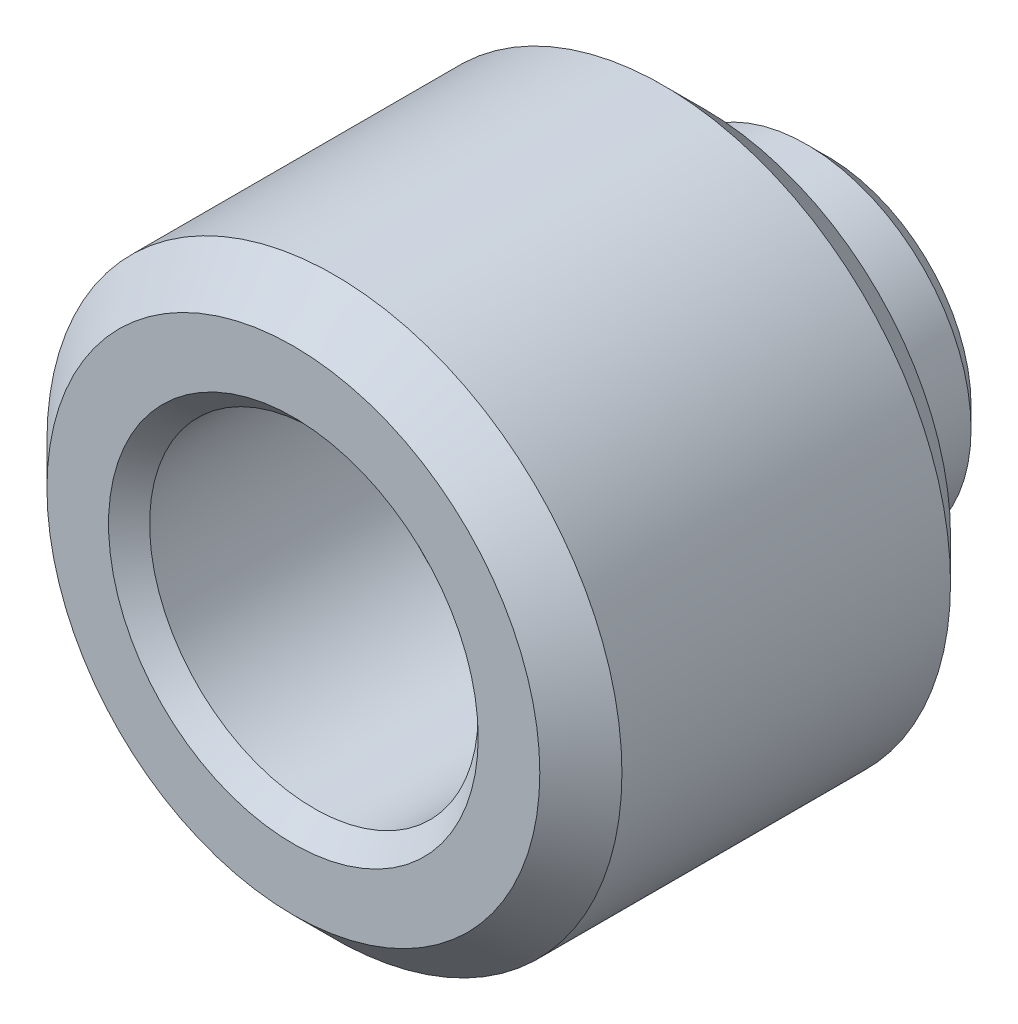
ISO-10303-21;
HEADER;
FILE_DESCRIPTION(('STEP AP214'),'2;1');
FILE_NAME('part.step','',(''),(''),'','','');
FILE_SCHEMA(('AUTOMOTIVE_DESIGN { 1 0 10303 214 1 1 1 1 }'));
ENDSEC;
DATA;
#1=APPLICATION_CONTEXT('core data for automotive mechanical design processes');
#2=APPLICATION_PROTOCOL_DEFINITION('international standard','automotive_design',2000,#1);
#3=PRODUCT_CONTEXT('',#1,'mechanical');
#4=PRODUCT('Part','Part','',(#3));
#5=PRODUCT_RELATED_PRODUCT_CATEGORY('part','',(#4));
#6=PRODUCT_DEFINITION_FORMATION('','',#4);
#7=PRODUCT_DEFINITION_CONTEXT('part definition',#1,'design');
#8=PRODUCT_DEFINITION('design','',#6,#7);
#9=PRODUCT_DEFINITION_SHAPE('','',#8);
#10=(LENGTH_UNIT() NAMED_UNIT(*) SI_UNIT(.MILLI.,.METRE.));
#11=(NAMED_UNIT(*) PLANE_ANGLE_UNIT() SI_UNIT($,.RADIAN.));
#12=(NAMED_UNIT(*) SI_UNIT($,.STERADIAN.) SOLID_ANGLE_UNIT());
#13=UNCERTAINTY_MEASURE_WITH_UNIT(LENGTH_MEASURE(1.E-05),#10,'distance_accuracy_value','');
#14=(GEOMETRIC_REPRESENTATION_CONTEXT(3) GLOBAL_UNCERTAINTY_ASSIGNED_CONTEXT((#13)) GLOBAL_UNIT_ASSIGNED_CONTEXT((#10,
#11,#12)) REPRESENTATION_CONTEXT('',''));
#15=CARTESIAN_POINT('',(0.,0.,0.));
#16=DIRECTION('',(0.,0.,1.));
#17=DIRECTION('',(1.,0.,0.));
#18=AXIS2_PLACEMENT_3D('',#15,#16,#17);
#19=CARTESIAN_POINT('',(42.8779007018823,-281.152618371509,10.));
#20=DIRECTION('',(0.,0.,1.));
#21=DIRECTION('',(1.,0.,0.));
#22=AXIS2_PLACEMENT_3D('',#19,#20,#21);
#23=PLANE('',#22);
#24=CARTESIAN_POINT('',(42.8779007018823,-281.152618371509,10.));
#25=DIRECTION('',(0.,0.,1.));
#26=DIRECTION('',(1.,0.,0.));
#27=AXIS2_PLACEMENT_3D('',#24,#25,#26);
#28=CIRCLE('',#27,4.50000000000025);
#29=CARTESIAN_POINT('',(47.3779007018826,-281.152618371509,10.));
#30=VERTEX_POINT('',#29);
#31=EDGE_CURVE('E10',#30,#30,#28,.F.);
#32=ORIENTED_EDGE('',*,*,#31,.T.);
#33=EDGE_LOOP('',(#32));
#34=FACE_BOUND('',#33,.T.);
#35=CARTESIAN_POINT('',(42.8779007018823,-281.152618371509,10.));
#36=DIRECTION('',(0.,0.,1.));
#37=DIRECTION('',(1.,0.,0.));
#38=AXIS2_PLACEMENT_3D('',#35,#36,#37);
#39=CIRCLE('',#38,6.);
#40=CARTESIAN_POINT('',(48.8779007018823,-281.152618371509,10.));
#41=VERTEX_POINT('',#40);
#42=EDGE_CURVE('E66',#41,#41,#39,.T.);
#43=ORIENTED_EDGE('',*,*,#42,.T.);
#44=EDGE_LOOP('',(#43));
#45=FACE_BOUND('',#44,.T.);
#46=ADVANCED_FACE('F38',(#34,#45),#23,.T.);
#47=CARTESIAN_POINT('',(42.8779007018823,-281.152618371509,0.));
#48=DIRECTION('',(0.,0.,1.));
#49=DIRECTION('',(1.,0.,0.));
#50=AXIS2_PLACEMENT_3D('',#47,#48,#49);
#51=PLANE('',#50);
#52=CARTESIAN_POINT('',(42.8779007018823,-281.152618371509,0.));
#53=DIRECTION('',(0.,0.,1.));
#54=DIRECTION('',(1.,0.,0.));
#55=AXIS2_PLACEMENT_3D('',#52,#53,#54);
#56=CIRCLE('',#55,5.99999999999998);
#57=CARTESIAN_POINT('',(48.8779007018823,-281.152618371509,0.));
#58=VERTEX_POINT('',#57);
#59=EDGE_CURVE('E69',#58,#58,#56,.F.);
#60=ORIENTED_EDGE('',*,*,#59,.T.);
#61=EDGE_LOOP('',(#60));
#62=FACE_BOUND('',#61,.T.);
#63=CARTESIAN_POINT('',(42.8779007018823,-281.152618371509,0.));
#64=DIRECTION('',(0.,0.,1.));
#65=DIRECTION('',(1.,0.,0.));
#66=AXIS2_PLACEMENT_3D('',#63,#64,#65);
#67=CIRCLE('',#66,4.00000000000024);
#68=CARTESIAN_POINT('',(46.8779007018826,-281.152618371509,0.));
#69=VERTEX_POINT('',#68);
#70=EDGE_CURVE('E84',#69,#69,#67,.F.);
#71=ORIENTED_EDGE('',*,*,#70,.F.);
#72=EDGE_LOOP('',(#71));
#73=FACE_BOUND('',#72,.T.);
#74=ADVANCED_FACE('F116',(#62,#73),#51,.F.);
#75=CARTESIAN_POINT('',(42.8779007018823,-281.152618371509,10.));
#76=DIRECTION('',(0.,0.,-1.));
#77=DIRECTION('',(-1.,0.,0.));
#78=AXIS2_PLACEMENT_3D('',#75,#76,#77);
#79=CYLINDRICAL_SURFACE('',#78,7.);
#80=CARTESIAN_POINT('',(42.8779007018823,-281.152618371509,1.));
#81=DIRECTION('',(0.,0.,1.));
#82=DIRECTION('',(1.,0.,0.));
#83=AXIS2_PLACEMENT_3D('',#80,#81,#82);
#84=CIRCLE('',#83,7.);
#85=CARTESIAN_POINT('',(49.8779007018823,-281.152618371509,1.));
#86=VERTEX_POINT('',#85);
#87=EDGE_CURVE('E73',#86,#86,#84,.T.);
#88=ORIENTED_EDGE('',*,*,#87,.T.);
#89=EDGE_LOOP('',(#88));
#90=FACE_BOUND('',#89,.T.);
#91=CARTESIAN_POINT('',(42.8779007018823,-281.152618371509,8.99999999999998));
#92=DIRECTION('',(0.,0.,1.));
#93=DIRECTION('',(1.,0.,0.));
#94=AXIS2_PLACEMENT_3D('',#91,#92,#93);
#95=CIRCLE('',#94,7.);
#96=CARTESIAN_POINT('',(49.8779007018823,-281.152618371509,8.99999999999998));
#97=VERTEX_POINT('',#96);
#98=EDGE_CURVE('E77',#97,#97,#95,.F.);
#99=ORIENTED_EDGE('',*,*,#98,.T.);
#100=EDGE_LOOP('',(#99));
#101=FACE_BOUND('',#100,.T.);
#102=ADVANCED_FACE('F121',(#90,#101),#79,.T.);
#103=CARTESIAN_POINT('',(42.8779007018823,-281.152618371509,10.));
#104=DIRECTION('',(0.,0.,-1.));
#105=DIRECTION('',(-1.,0.,0.));
#106=AXIS2_PLACEMENT_3D('',#103,#104,#105);
#107=CYLINDRICAL_SURFACE('',#106,4.00000000000025);
#108=CARTESIAN_POINT('',(42.8779007018823,-281.152618371509,9.5));
#109=DIRECTION('',(0.,0.,1.));
#110=DIRECTION('',(1.,0.,0.));
#111=AXIS2_PLACEMENT_3D('',#108,#109,#110);
#112=CIRCLE('',#111,4.00000000000025);
#113=CARTESIAN_POINT('',(46.8779007018826,-281.152618371509,9.5));
#114=VERTEX_POINT('',#113);
#115=EDGE_CURVE('E47',#114,#114,#112,.T.);
#116=ORIENTED_EDGE('',*,*,#115,.T.);
#117=EDGE_LOOP('',(#116));
#118=FACE_BOUND('',#117,.T.);
#119=CARTESIAN_POINT('',(42.8779007018823,-281.152618371509,4.));
#120=DIRECTION('',(0.,0.,1.));
#121=DIRECTION('',(1.,0.,0.));
#122=AXIS2_PLACEMENT_3D('',#119,#120,#121);
#123=CIRCLE('',#122,4.00000000000025);
#124=CARTESIAN_POINT('',(46.8779007018826,-281.152618371509,4.));
#125=VERTEX_POINT('',#124);
#126=EDGE_CURVE('E81',#125,#125,#123,.T.);
#127=ORIENTED_EDGE('',*,*,#126,.F.);
#128=EDGE_LOOP('',(#127));
#129=FACE_BOUND('',#128,.T.);
#130=ADVANCED_FACE('F111',(#118,#129),#107,.F.);
#131=CARTESIAN_POINT('',(42.8779007018823,-281.152618371509,4.));
#132=DIRECTION('',(0.,0.,-1.));
#133=DIRECTION('',(-1.,0.,0.));
#134=AXIS2_PLACEMENT_3D('',#131,#132,#133);
#135=CYLINDRICAL_SURFACE('',#134,4.00000000000024);
#136=CARTESIAN_POINT('',(42.8779007018823,-281.152618371509,-2.5));
#137=DIRECTION('',(0.,0.,1.));
#138=DIRECTION('',(1.,0.,0.));
#139=AXIS2_PLACEMENT_3D('',#136,#137,#138);
#140=CIRCLE('',#139,4.00000000000024);
#141=CARTESIAN_POINT('',(46.8779007018826,-281.152618371509,-2.5));
#142=VERTEX_POINT('',#141);
#143=EDGE_CURVE('E60',#142,#142,#140,.T.);
#144=ORIENTED_EDGE('',*,*,#143,.T.);
#145=EDGE_LOOP('',(#144));
#146=FACE_BOUND('',#145,.T.);
#147=ORIENTED_EDGE('',*,*,#70,.T.);
#148=EDGE_LOOP('',(#147));
#149=FACE_BOUND('',#148,.T.);
#150=ADVANCED_FACE('F102',(#146,#149),#135,.T.);
#151=CARTESIAN_POINT('',(42.8779007018823,-281.152618371509,4.));
#152=DIRECTION('',(0.,0.,1.));
#153=DIRECTION('',(1.,0.,0.));
#154=AXIS2_PLACEMENT_3D('',#151,#152,#153);
#155=PLANE('',#154);
#156=ORIENTED_EDGE('',*,*,#126,.T.);
#157=EDGE_LOOP('',(#156));
#158=FACE_BOUND('',#157,.T.);
#159=CARTESIAN_POINT('',(42.877900701883,-281.152618371509,4.));
#160=DIRECTION('',(0.,0.,1.));
#161=DIRECTION('',(1.,0.,0.));
#162=AXIS2_PLACEMENT_3D('',#159,#160,#161);
#163=CIRCLE('',#162,2.2);
#164=CARTESIAN_POINT('',(45.077900701883,-281.152618371509,4.));
#165=VERTEX_POINT('',#164);
#166=EDGE_CURVE('E88',#165,#165,#163,.T.);
#167=ORIENTED_EDGE('',*,*,#166,.F.);
#168=EDGE_LOOP('',(#167));
#169=FACE_BOUND('',#168,.T.);
#170=ADVANCED_FACE('F99',(#158,#169),#155,.T.);
#171=CARTESIAN_POINT('',(42.8779007018823,-281.152618371509,-3.));
#172=DIRECTION('',(0.,0.,1.));
#173=DIRECTION('',(1.,0.,0.));
#174=AXIS2_PLACEMENT_3D('',#171,#172,#173);
#175=PLANE('',#174);
#176=CARTESIAN_POINT('',(42.8779007018823,-281.152618371509,-3.));
#177=DIRECTION('',(0.,0.,1.));
#178=DIRECTION('',(1.,0.,0.));
#179=AXIS2_PLACEMENT_3D('',#176,#177,#178);
#180=CIRCLE('',#179,3.50000000000024);
#181=CARTESIAN_POINT('',(46.3779007018826,-281.152618371509,-3.));
#182=VERTEX_POINT('',#181);
#183=EDGE_CURVE('E54',#182,#182,#180,.F.);
#184=ORIENTED_EDGE('',*,*,#183,.T.);
#185=EDGE_LOOP('',(#184));
#186=FACE_BOUND('',#185,.T.);
#187=CARTESIAN_POINT('',(42.877900701883,-281.152618371509,-3.));
#188=DIRECTION('',(0.,0.,1.));
#189=DIRECTION('',(1.,0.,0.));
#190=AXIS2_PLACEMENT_3D('',#187,#188,#189);
#191=CIRCLE('',#190,2.2);
#192=CARTESIAN_POINT('',(45.077900701883,-281.152618371509,-3.));
#193=VERTEX_POINT('',#192);
#194=EDGE_CURVE('E89',#193,#193,#191,.T.);
#195=ORIENTED_EDGE('',*,*,#194,.T.);
#196=EDGE_LOOP('',(#195));
#197=FACE_BOUND('',#196,.T.);
#198=ADVANCED_FACE('F101',(#186,#197),#175,.F.);
#199=CARTESIAN_POINT('',(42.877900701883,-281.152618371509,4.));
#200=DIRECTION('',(0.,0.,-1.));
#201=DIRECTION('',(-1.,0.,0.));
#202=AXIS2_PLACEMENT_3D('',#199,#200,#201);
#203=CYLINDRICAL_SURFACE('',#202,2.2);
#204=ORIENTED_EDGE('',*,*,#166,.T.);
#205=EDGE_LOOP('',(#204));
#206=FACE_BOUND('',#205,.T.);
#207=ORIENTED_EDGE('',*,*,#194,.F.);
#208=EDGE_LOOP('',(#207));
#209=FACE_BOUND('',#208,.T.);
#210=ADVANCED_FACE('F96',(#206,#209),#203,.F.);
#211=CARTESIAN_POINT('',(42.8779007018823,-281.152618371509,1.));
#212=DIRECTION('',(0.,0.,1.));
#213=DIRECTION('',(1.,0.,0.));
#214=AXIS2_PLACEMENT_3D('',#211,#212,#213);
#215=CONICAL_SURFACE('',#214,7.,0.785398163397456);
#216=ORIENTED_EDGE('',*,*,#59,.F.);
#217=EDGE_LOOP('',(#216));
#218=FACE_BOUND('',#217,.T.);
#219=ORIENTED_EDGE('',*,*,#87,.F.);
#220=EDGE_LOOP('',(#219));
#221=FACE_BOUND('',#220,.T.);
#222=ADVANCED_FACE('F131',(#218,#221),#215,.T.);
#223=CARTESIAN_POINT('',(42.8779007018823,-281.152618371509,10.));
#224=DIRECTION('',(0.,0.,-1.));
#225=DIRECTION('',(-1.,0.,0.));
#226=AXIS2_PLACEMENT_3D('',#223,#224,#225);
#227=CONICAL_SURFACE('',#226,6.,0.785398163397441);
#228=ORIENTED_EDGE('',*,*,#98,.F.);
#229=EDGE_LOOP('',(#228));
#230=FACE_BOUND('',#229,.T.);
#231=ORIENTED_EDGE('',*,*,#42,.F.);
#232=EDGE_LOOP('',(#231));
#233=FACE_BOUND('',#232,.T.);
#234=ADVANCED_FACE('F137',(#230,#233),#227,.T.);
#235=CARTESIAN_POINT('',(42.8779007018823,-281.152618371509,-2.5));
#236=DIRECTION('',(0.,0.,1.));
#237=DIRECTION('',(1.,0.,0.));
#238=AXIS2_PLACEMENT_3D('',#235,#236,#237);
#239=CONICAL_SURFACE('',#238,4.00000000000024,0.785398163397445);
#240=ORIENTED_EDGE('',*,*,#183,.F.);
#241=EDGE_LOOP('',(#240));
#242=FACE_BOUND('',#241,.T.);
#243=ORIENTED_EDGE('',*,*,#143,.F.);
#244=EDGE_LOOP('',(#243));
#245=FACE_BOUND('',#244,.T.);
#246=ADVANCED_FACE('F143',(#242,#245),#239,.T.);
#247=CARTESIAN_POINT('',(42.8779007018823,-281.152618371509,9.5));
#248=DIRECTION('',(0.,0.,1.));
#249=DIRECTION('',(1.,0.,0.));
#250=AXIS2_PLACEMENT_3D('',#247,#248,#249);
#251=CONICAL_SURFACE('',#250,4.00000000000025,0.785398163397448);
#252=ORIENTED_EDGE('',*,*,#31,.F.);
#253=EDGE_LOOP('',(#252));
#254=FACE_BOUND('',#253,.T.);
#255=ORIENTED_EDGE('',*,*,#115,.F.);
#256=EDGE_LOOP('',(#255));
#257=FACE_BOUND('',#256,.T.);
#258=ADVANCED_FACE('F41',(#254,#257),#251,.F.);
#259=CLOSED_SHELL('',(#46,#74,#102,#130,#150,#170,#198,#210,#222,#234,#246,#258));
#260=MANIFOLD_SOLID_BREP('B2',#259);
#261=ADVANCED_BREP_SHAPE_REPRESENTATION('',(#18,#260),#14);
#262=SHAPE_DEFINITION_REPRESENTATION(#9,#261);
ENDSEC;
END-ISO-10303-21;
